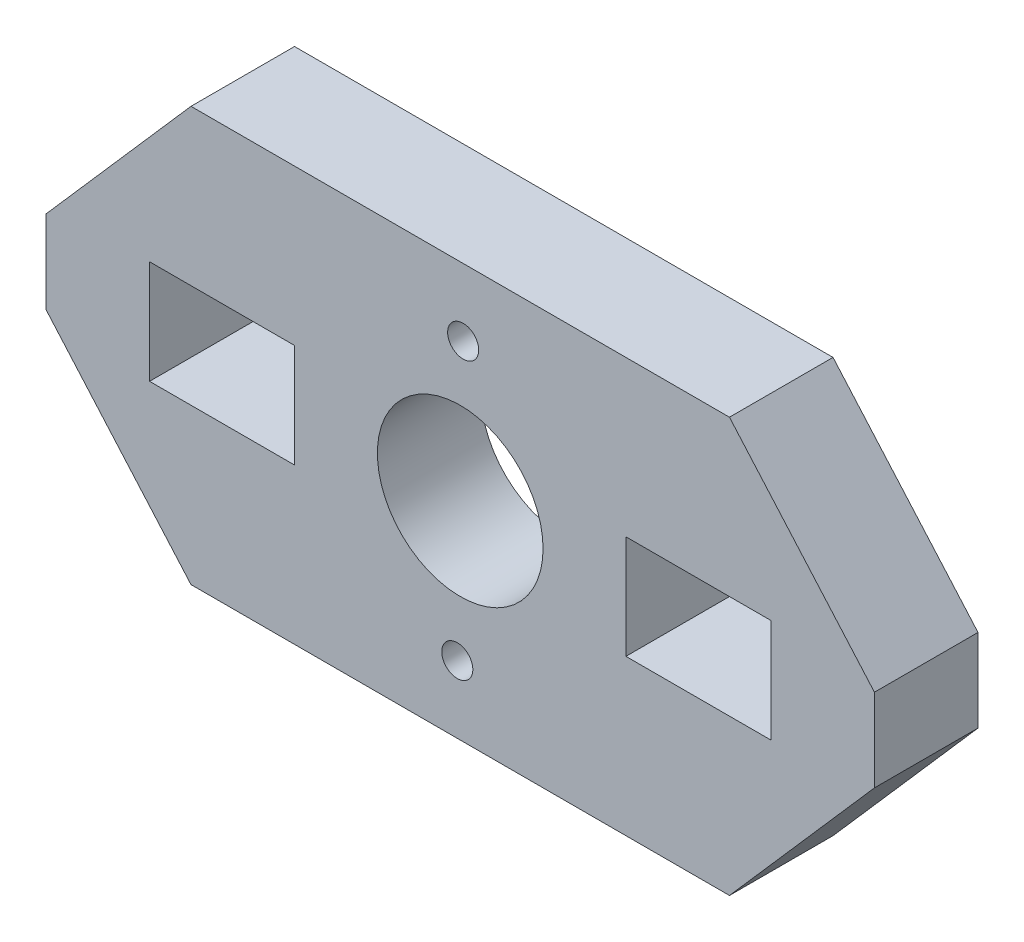
ISO-10303-21;
HEADER;
FILE_DESCRIPTION(('STEP AP214'),'2;1');
FILE_NAME('part.step','',(''),(''),'','','');
FILE_SCHEMA(('AUTOMOTIVE_DESIGN { 1 0 10303 214 1 1 1 1 }'));
ENDSEC;
DATA;
#1=APPLICATION_CONTEXT('core data for automotive mechanical design processes');
#2=APPLICATION_PROTOCOL_DEFINITION('international standard','automotive_design',2000,#1);
#3=PRODUCT_CONTEXT('',#1,'mechanical');
#4=PRODUCT('Part','Part','',(#3));
#5=PRODUCT_RELATED_PRODUCT_CATEGORY('part','',(#4));
#6=PRODUCT_DEFINITION_FORMATION('','',#4);
#7=PRODUCT_DEFINITION_CONTEXT('part definition',#1,'design');
#8=PRODUCT_DEFINITION('design','',#6,#7);
#9=PRODUCT_DEFINITION_SHAPE('','',#8);
#10=(LENGTH_UNIT() NAMED_UNIT(*) SI_UNIT(.MILLI.,.METRE.));
#11=(NAMED_UNIT(*) PLANE_ANGLE_UNIT() SI_UNIT($,.RADIAN.));
#12=(NAMED_UNIT(*) SI_UNIT($,.STERADIAN.) SOLID_ANGLE_UNIT());
#13=UNCERTAINTY_MEASURE_WITH_UNIT(LENGTH_MEASURE(1.E-05),#10,'distance_accuracy_value','');
#14=(GEOMETRIC_REPRESENTATION_CONTEXT(3) GLOBAL_UNCERTAINTY_ASSIGNED_CONTEXT((#13)) GLOBAL_UNIT_ASSIGNED_CONTEXT((#10,
#11,#12)) REPRESENTATION_CONTEXT('',''));
#15=CARTESIAN_POINT('',(0.,0.,0.));
#16=DIRECTION('',(0.,0.,1.));
#17=DIRECTION('',(1.,0.,0.));
#18=AXIS2_PLACEMENT_3D('',#15,#16,#17);
#19=CARTESIAN_POINT('',(0.,0.,5.));
#20=DIRECTION('',(0.,0.,-1.));
#21=DIRECTION('',(-1.,0.,0.));
#22=AXIS2_PLACEMENT_3D('',#19,#20,#21);
#23=PLANE('',#22);
#24=DIRECTION('',(1.,0.,0.));
#25=VECTOR('',#24,1.);
#26=CARTESIAN_POINT('',(0.,-6.30714285714286,5.));
#27=LINE('',#26,#25);
#28=CARTESIAN_POINT('',(-32.7714285714286,-6.30714285714286,5.));
#29=VERTEX_POINT('',#28);
#30=CARTESIAN_POINT('',(-25.7714285714286,-6.30714285714286,5.));
#31=VERTEX_POINT('',#30);
#32=EDGE_CURVE('E210',#29,#31,#27,.T.);
#33=ORIENTED_EDGE('',*,*,#32,.T.);
#34=DIRECTION('',(0.,-1.,0.));
#35=VECTOR('',#34,1.);
#36=CARTESIAN_POINT('',(-25.7714285714286,0.,5.));
#37=LINE('',#36,#35);
#38=CARTESIAN_POINT('',(-25.7714285714286,-11.3071428571429,5.));
#39=VERTEX_POINT('',#38);
#40=EDGE_CURVE('E152',#31,#39,#37,.T.);
#41=ORIENTED_EDGE('',*,*,#40,.T.);
#42=DIRECTION('',(1.,0.,0.));
#43=VECTOR('',#42,1.);
#44=CARTESIAN_POINT('',(0.,-11.3071428571429,5.));
#45=LINE('',#44,#43);
#46=CARTESIAN_POINT('',(-32.7714285714286,-11.3071428571429,5.));
#47=VERTEX_POINT('',#46);
#48=EDGE_CURVE('E206',#47,#39,#45,.T.);
#49=ORIENTED_EDGE('',*,*,#48,.F.);
#50=DIRECTION('',(0.,-1.,0.));
#51=VECTOR('',#50,1.);
#52=CARTESIAN_POINT('',(-32.7714285714286,0.,5.));
#53=LINE('',#52,#51);
#54=EDGE_CURVE('E208',#29,#47,#53,.T.);
#55=ORIENTED_EDGE('',*,*,#54,.F.);
#56=EDGE_LOOP('',(#33,#41,#49,#55));
#57=FACE_BOUND('',#56,.T.);
#58=DIRECTION('',(-1.,0.,0.));
#59=VECTOR('',#58,1.);
#60=CARTESIAN_POINT('',(0.,-6.30714285714286,5.));
#61=LINE('',#60,#59);
#62=CARTESIAN_POINT('',(-2.77142857142857,-6.30714285714286,5.));
#63=VERTEX_POINT('',#62);
#64=CARTESIAN_POINT('',(-9.77142857142857,-6.30714285714286,5.));
#65=VERTEX_POINT('',#64);
#66=EDGE_CURVE('E201',#63,#65,#61,.T.);
#67=ORIENTED_EDGE('',*,*,#66,.F.);
#68=DIRECTION('',(0.,-1.,0.));
#69=VECTOR('',#68,1.);
#70=CARTESIAN_POINT('',(-2.77142857142857,0.,5.));
#71=LINE('',#70,#69);
#72=CARTESIAN_POINT('',(-2.77142857142857,-11.3071428571429,5.));
#73=VERTEX_POINT('',#72);
#74=EDGE_CURVE('E203',#63,#73,#71,.T.);
#75=ORIENTED_EDGE('',*,*,#74,.T.);
#76=DIRECTION('',(-1.,0.,0.));
#77=VECTOR('',#76,1.);
#78=CARTESIAN_POINT('',(0.,-11.3071428571429,5.));
#79=LINE('',#78,#77);
#80=CARTESIAN_POINT('',(-9.77142857142857,-11.3071428571429,5.));
#81=VERTEX_POINT('',#80);
#82=EDGE_CURVE('E155',#73,#81,#79,.T.);
#83=ORIENTED_EDGE('',*,*,#82,.T.);
#84=DIRECTION('',(0.,-1.,0.));
#85=VECTOR('',#84,1.);
#86=CARTESIAN_POINT('',(-9.77142857142858,0.,5.));
#87=LINE('',#86,#85);
#88=EDGE_CURVE('E199',#65,#81,#87,.T.);
#89=ORIENTED_EDGE('',*,*,#88,.F.);
#90=EDGE_LOOP('',(#67,#75,#83,#89));
#91=FACE_BOUND('',#90,.T.);
#92=DIRECTION('',(0.658504607868518,-0.752576694706878,0.));
#93=VECTOR('',#92,1.);
#94=CARTESIAN_POINT('',(-37.7714285714286,-10.8071428571429,5.));
#95=LINE('',#94,#93);
#96=CARTESIAN_POINT('',(-37.7714285714286,-10.8071428571429,5.));
#97=VERTEX_POINT('',#96);
#98=CARTESIAN_POINT('',(-30.7714285714286,-18.8071428571429,5.));
#99=VERTEX_POINT('',#98);
#100=EDGE_CURVE('E232',#97,#99,#95,.T.);
#101=ORIENTED_EDGE('',*,*,#100,.T.);
#102=DIRECTION('',(1.,0.,0.));
#103=VECTOR('',#102,1.);
#104=CARTESIAN_POINT('',(-30.7714285714286,-18.8071428571429,5.));
#105=LINE('',#104,#103);
#106=CARTESIAN_POINT('',(-4.77142857142857,-18.8071428571429,5.));
#107=VERTEX_POINT('',#106);
#108=EDGE_CURVE('E235',#99,#107,#105,.T.);
#109=ORIENTED_EDGE('',*,*,#108,.T.);
#110=DIRECTION('',(0.658504607868518,0.752576694706878,0.));
#111=VECTOR('',#110,1.);
#112=CARTESIAN_POINT('',(2.22857142857143,-10.8071428571429,5.));
#113=LINE('',#112,#111);
#114=CARTESIAN_POINT('',(2.22857142857143,-10.8071428571429,5.));
#115=VERTEX_POINT('',#114);
#116=EDGE_CURVE('E238',#107,#115,#113,.T.);
#117=ORIENTED_EDGE('',*,*,#116,.T.);
#118=DIRECTION('',(0.,1.,0.));
#119=VECTOR('',#118,1.);
#120=CARTESIAN_POINT('',(2.22857142857143,-6.80714285714286,5.));
#121=LINE('',#120,#119);
#122=CARTESIAN_POINT('',(2.22857142857143,-6.80714285714286,5.));
#123=VERTEX_POINT('',#122);
#124=EDGE_CURVE('E240',#115,#123,#121,.T.);
#125=ORIENTED_EDGE('',*,*,#124,.T.);
#126=DIRECTION('',(-0.658504607868518,0.752576694706878,0.));
#127=VECTOR('',#126,1.);
#128=CARTESIAN_POINT('',(-4.77142857142858,1.19285714285715,5.));
#129=LINE('',#128,#127);
#130=CARTESIAN_POINT('',(-4.77142857142858,1.19285714285715,5.));
#131=VERTEX_POINT('',#130);
#132=EDGE_CURVE('E242',#123,#131,#129,.T.);
#133=ORIENTED_EDGE('',*,*,#132,.T.);
#134=DIRECTION('',(-1.,0.,0.));
#135=VECTOR('',#134,1.);
#136=CARTESIAN_POINT('',(-30.7714285714286,1.19285714285714,5.));
#137=LINE('',#136,#135);
#138=CARTESIAN_POINT('',(-30.7714285714286,1.19285714285714,5.));
#139=VERTEX_POINT('',#138);
#140=EDGE_CURVE('E244',#131,#139,#137,.T.);
#141=ORIENTED_EDGE('',*,*,#140,.T.);
#142=DIRECTION('',(-0.658504607868518,-0.752576694706878,0.));
#143=VECTOR('',#142,1.);
#144=CARTESIAN_POINT('',(-30.7714285714286,1.19285714285714,5.));
#145=LINE('',#144,#143);
#146=CARTESIAN_POINT('',(-37.7714285714286,-6.80714285714286,5.));
#147=VERTEX_POINT('',#146);
#148=EDGE_CURVE('E246',#139,#147,#145,.T.);
#149=ORIENTED_EDGE('',*,*,#148,.T.);
#150=DIRECTION('',(0.,-1.,0.));
#151=VECTOR('',#150,1.);
#152=CARTESIAN_POINT('',(-37.7714285714286,-6.80714285714286,5.));
#153=LINE('',#152,#151);
#154=EDGE_CURVE('E248',#147,#97,#153,.T.);
#155=ORIENTED_EDGE('',*,*,#154,.T.);
#156=EDGE_LOOP('',(#101,#109,#117,#125,#133,#141,#149,#155));
#157=FACE_BOUND('',#156,.T.);
#158=CARTESIAN_POINT('',(-17.7714285714286,-8.80714285714286,5.));
#159=DIRECTION('',(0.,0.,1.));
#160=DIRECTION('',(1.,0.,0.));
#161=AXIS2_PLACEMENT_3D('',#158,#159,#160);
#162=CIRCLE('',#161,4.);
#163=CARTESIAN_POINT('',(-13.7714285714286,-8.80714285714286,5.));
#164=VERTEX_POINT('',#163);
#165=EDGE_CURVE('E226',#164,#164,#162,.T.);
#166=ORIENTED_EDGE('',*,*,#165,.F.);
#167=EDGE_LOOP('',(#166));
#168=FACE_BOUND('',#167,.T.);
#169=CARTESIAN_POINT('',(-17.6297454846945,-2.05863013549594,5.));
#170=DIRECTION('',(0.,0.,1.));
#171=DIRECTION('',(1.,0.,0.));
#172=AXIS2_PLACEMENT_3D('',#169,#170,#171);
#173=CIRCLE('',#172,0.749999999999998);
#174=CARTESIAN_POINT('',(-16.8797454846945,-2.05863013549594,5.));
#175=VERTEX_POINT('',#174);
#176=EDGE_CURVE('E220',#175,#175,#173,.T.);
#177=ORIENTED_EDGE('',*,*,#176,.F.);
#178=EDGE_LOOP('',(#177));
#179=FACE_BOUND('',#178,.T.);
#180=CARTESIAN_POINT('',(-17.9131116635467,-15.5556558674371,5.));
#181=DIRECTION('',(0.,0.,1.));
#182=DIRECTION('',(1.,0.,0.));
#183=AXIS2_PLACEMENT_3D('',#180,#181,#182);
#184=CIRCLE('',#183,0.749999999999999);
#185=CARTESIAN_POINT('',(-17.1631116635467,-15.5556558674371,5.));
#186=VERTEX_POINT('',#185);
#187=EDGE_CURVE('E214',#186,#186,#184,.T.);
#188=ORIENTED_EDGE('',*,*,#187,.F.);
#189=EDGE_LOOP('',(#188));
#190=FACE_BOUND('',#189,.T.);
#191=ADVANCED_FACE('F32',(#57,#91,#157,#168,#179,#190),#23,.F.);
#192=CARTESIAN_POINT('',(0.,0.,0.));
#193=DIRECTION('',(0.,0.,-1.));
#194=DIRECTION('',(-1.,0.,0.));
#195=AXIS2_PLACEMENT_3D('',#192,#193,#194);
#196=PLANE('',#195);
#197=DIRECTION('',(0.,-1.,0.));
#198=VECTOR('',#197,1.);
#199=CARTESIAN_POINT('',(-25.7714285714286,0.,0.));
#200=LINE('',#199,#198);
#201=CARTESIAN_POINT('',(-25.7714285714286,-6.30714285714286,0.));
#202=VERTEX_POINT('',#201);
#203=CARTESIAN_POINT('',(-25.7714285714286,-11.3071428571429,0.));
#204=VERTEX_POINT('',#203);
#205=EDGE_CURVE('E149',#202,#204,#200,.T.);
#206=ORIENTED_EDGE('',*,*,#205,.F.);
#207=DIRECTION('',(1.,0.,0.));
#208=VECTOR('',#207,1.);
#209=CARTESIAN_POINT('',(0.,-6.30714285714286,0.));
#210=LINE('',#209,#208);
#211=CARTESIAN_POINT('',(-32.7714285714286,-6.30714285714286,0.));
#212=VERTEX_POINT('',#211);
#213=EDGE_CURVE('E159',#212,#202,#210,.T.);
#214=ORIENTED_EDGE('',*,*,#213,.F.);
#215=DIRECTION('',(0.,-1.,0.));
#216=VECTOR('',#215,1.);
#217=CARTESIAN_POINT('',(-32.7714285714286,0.,0.));
#218=LINE('',#217,#216);
#219=CARTESIAN_POINT('',(-32.7714285714286,-11.3071428571429,0.));
#220=VERTEX_POINT('',#219);
#221=EDGE_CURVE('E165',#212,#220,#218,.T.);
#222=ORIENTED_EDGE('',*,*,#221,.T.);
#223=DIRECTION('',(1.,0.,0.));
#224=VECTOR('',#223,1.);
#225=CARTESIAN_POINT('',(0.,-11.3071428571429,0.));
#226=LINE('',#225,#224);
#227=EDGE_CURVE('E170',#220,#204,#226,.T.);
#228=ORIENTED_EDGE('',*,*,#227,.T.);
#229=EDGE_LOOP('',(#206,#214,#222,#228));
#230=FACE_BOUND('',#229,.T.);
#231=DIRECTION('',(0.,-1.,0.));
#232=VECTOR('',#231,1.);
#233=CARTESIAN_POINT('',(-2.77142857142857,0.,0.));
#234=LINE('',#233,#232);
#235=CARTESIAN_POINT('',(-2.77142857142857,-6.30714285714286,0.));
#236=VERTEX_POINT('',#235);
#237=CARTESIAN_POINT('',(-2.77142857142857,-11.3071428571429,0.));
#238=VERTEX_POINT('',#237);
#239=EDGE_CURVE('E182',#236,#238,#234,.T.);
#240=ORIENTED_EDGE('',*,*,#239,.F.);
#241=DIRECTION('',(-1.,0.,0.));
#242=VECTOR('',#241,1.);
#243=CARTESIAN_POINT('',(0.,-6.30714285714286,0.));
#244=LINE('',#243,#242);
#245=CARTESIAN_POINT('',(-9.77142857142857,-6.30714285714286,0.));
#246=VERTEX_POINT('',#245);
#247=EDGE_CURVE('E184',#236,#246,#244,.T.);
#248=ORIENTED_EDGE('',*,*,#247,.T.);
#249=DIRECTION('',(0.,-1.,0.));
#250=VECTOR('',#249,1.);
#251=CARTESIAN_POINT('',(-9.77142857142858,0.,0.));
#252=LINE('',#251,#250);
#253=CARTESIAN_POINT('',(-9.77142857142857,-11.3071428571429,0.));
#254=VERTEX_POINT('',#253);
#255=EDGE_CURVE('E187',#246,#254,#252,.T.);
#256=ORIENTED_EDGE('',*,*,#255,.T.);
#257=DIRECTION('',(-1.,0.,0.));
#258=VECTOR('',#257,1.);
#259=CARTESIAN_POINT('',(0.,-11.3071428571429,0.));
#260=LINE('',#259,#258);
#261=EDGE_CURVE('E190',#238,#254,#260,.T.);
#262=ORIENTED_EDGE('',*,*,#261,.F.);
#263=EDGE_LOOP('',(#240,#248,#256,#262));
#264=FACE_BOUND('',#263,.T.);
#265=CARTESIAN_POINT('',(-17.6297454846945,-2.05863013549594,0.));
#266=DIRECTION('',(0.,0.,1.));
#267=DIRECTION('',(1.,0.,0.));
#268=AXIS2_PLACEMENT_3D('',#265,#266,#267);
#269=CIRCLE('',#268,0.749999999999998);
#270=CARTESIAN_POINT('',(-16.8797454846945,-2.05863013549594,0.));
#271=VERTEX_POINT('',#270);
#272=EDGE_CURVE('E217',#271,#271,#269,.T.);
#273=ORIENTED_EDGE('',*,*,#272,.T.);
#274=EDGE_LOOP('',(#273));
#275=FACE_BOUND('',#274,.T.);
#276=DIRECTION('',(0.658504607868518,-0.752576694706878,0.));
#277=VECTOR('',#276,1.);
#278=CARTESIAN_POINT('',(-37.7714285714286,-10.8071428571429,0.));
#279=LINE('',#278,#277);
#280=CARTESIAN_POINT('',(-37.7714285714286,-10.8071428571429,0.));
#281=VERTEX_POINT('',#280);
#282=CARTESIAN_POINT('',(-30.7714285714286,-18.8071428571429,0.));
#283=VERTEX_POINT('',#282);
#284=EDGE_CURVE('E229',#281,#283,#279,.T.);
#285=ORIENTED_EDGE('',*,*,#284,.F.);
#286=DIRECTION('',(0.,-1.,0.));
#287=VECTOR('',#286,1.);
#288=CARTESIAN_POINT('',(-37.7714285714286,-6.80714285714286,0.));
#289=LINE('',#288,#287);
#290=CARTESIAN_POINT('',(-37.7714285714286,-6.80714285714286,0.));
#291=VERTEX_POINT('',#290);
#292=EDGE_CURVE('E236',#291,#281,#289,.T.);
#293=ORIENTED_EDGE('',*,*,#292,.F.);
#294=DIRECTION('',(-0.658504607868518,-0.752576694706878,0.));
#295=VECTOR('',#294,1.);
#296=CARTESIAN_POINT('',(-30.7714285714286,1.19285714285714,0.));
#297=LINE('',#296,#295);
#298=CARTESIAN_POINT('',(-30.7714285714286,1.19285714285714,0.));
#299=VERTEX_POINT('',#298);
#300=EDGE_CURVE('E263',#299,#291,#297,.T.);
#301=ORIENTED_EDGE('',*,*,#300,.F.);
#302=DIRECTION('',(-1.,0.,0.));
#303=VECTOR('',#302,1.);
#304=CARTESIAN_POINT('',(-30.7714285714286,1.19285714285714,0.));
#305=LINE('',#304,#303);
#306=CARTESIAN_POINT('',(-4.77142857142858,1.19285714285715,0.));
#307=VERTEX_POINT('',#306);
#308=EDGE_CURVE('E261',#307,#299,#305,.T.);
#309=ORIENTED_EDGE('',*,*,#308,.F.);
#310=DIRECTION('',(-0.658504607868518,0.752576694706878,0.));
#311=VECTOR('',#310,1.);
#312=CARTESIAN_POINT('',(-4.77142857142858,1.19285714285715,0.));
#313=LINE('',#312,#311);
#314=CARTESIAN_POINT('',(2.22857142857143,-6.80714285714286,0.));
#315=VERTEX_POINT('',#314);
#316=EDGE_CURVE('E259',#315,#307,#313,.T.);
#317=ORIENTED_EDGE('',*,*,#316,.F.);
#318=DIRECTION('',(0.,1.,0.));
#319=VECTOR('',#318,1.);
#320=CARTESIAN_POINT('',(2.22857142857143,-6.80714285714286,0.));
#321=LINE('',#320,#319);
#322=CARTESIAN_POINT('',(2.22857142857143,-10.8071428571429,0.));
#323=VERTEX_POINT('',#322);
#324=EDGE_CURVE('E257',#323,#315,#321,.T.);
#325=ORIENTED_EDGE('',*,*,#324,.F.);
#326=DIRECTION('',(0.658504607868518,0.752576694706878,0.));
#327=VECTOR('',#326,1.);
#328=CARTESIAN_POINT('',(2.22857142857143,-10.8071428571429,0.));
#329=LINE('',#328,#327);
#330=CARTESIAN_POINT('',(-4.77142857142857,-18.8071428571429,0.));
#331=VERTEX_POINT('',#330);
#332=EDGE_CURVE('E255',#331,#323,#329,.T.);
#333=ORIENTED_EDGE('',*,*,#332,.F.);
#334=DIRECTION('',(1.,0.,0.));
#335=VECTOR('',#334,1.);
#336=CARTESIAN_POINT('',(-30.7714285714286,-18.8071428571429,0.));
#337=LINE('',#336,#335);
#338=EDGE_CURVE('E253',#283,#331,#337,.T.);
#339=ORIENTED_EDGE('',*,*,#338,.F.);
#340=EDGE_LOOP('',(#285,#293,#301,#309,#317,#325,#333,#339));
#341=FACE_BOUND('',#340,.T.);
#342=CARTESIAN_POINT('',(-17.7714285714286,-8.80714285714286,0.));
#343=DIRECTION('',(0.,0.,1.));
#344=DIRECTION('',(1.,0.,0.));
#345=AXIS2_PLACEMENT_3D('',#342,#343,#344);
#346=CIRCLE('',#345,4.);
#347=CARTESIAN_POINT('',(-13.7714285714286,-8.80714285714286,0.));
#348=VERTEX_POINT('',#347);
#349=EDGE_CURVE('E223',#348,#348,#346,.T.);
#350=ORIENTED_EDGE('',*,*,#349,.T.);
#351=EDGE_LOOP('',(#350));
#352=FACE_BOUND('',#351,.T.);
#353=CARTESIAN_POINT('',(-17.9131116635467,-15.5556558674371,0.));
#354=DIRECTION('',(0.,0.,1.));
#355=DIRECTION('',(1.,0.,0.));
#356=AXIS2_PLACEMENT_3D('',#353,#354,#355);
#357=CIRCLE('',#356,0.749999999999999);
#358=CARTESIAN_POINT('',(-17.1631116635467,-15.5556558674371,0.));
#359=VERTEX_POINT('',#358);
#360=EDGE_CURVE('E213',#359,#359,#357,.T.);
#361=ORIENTED_EDGE('',*,*,#360,.T.);
#362=EDGE_LOOP('',(#361));
#363=FACE_BOUND('',#362,.T.);
#364=ADVANCED_FACE('F168',(#230,#264,#275,#341,#352,#363),#196,.T.);
#365=CARTESIAN_POINT('',(-37.7714285714286,-10.8071428571429,5.));
#366=DIRECTION('',(0.752576694706878,0.658504607868518,0.));
#367=DIRECTION('',(-0.658504607868518,0.752576694706878,0.));
#368=AXIS2_PLACEMENT_3D('',#365,#366,#367);
#369=PLANE('',#368);
#370=ORIENTED_EDGE('',*,*,#284,.T.);
#371=DIRECTION('',(0.,0.,-1.));
#372=VECTOR('',#371,1.);
#373=CARTESIAN_POINT('',(-30.7714285714286,-18.8071428571429,5.));
#374=LINE('',#373,#372);
#375=EDGE_CURVE('E11',#99,#283,#374,.T.);
#376=ORIENTED_EDGE('',*,*,#375,.F.);
#377=ORIENTED_EDGE('',*,*,#100,.F.);
#378=DIRECTION('',(0.,0.,-1.));
#379=VECTOR('',#378,1.);
#380=CARTESIAN_POINT('',(-37.7714285714286,-10.8071428571429,5.));
#381=LINE('',#380,#379);
#382=EDGE_CURVE('E250',#97,#281,#381,.T.);
#383=ORIENTED_EDGE('',*,*,#382,.T.);
#384=EDGE_LOOP('',(#370,#376,#377,#383));
#385=FACE_BOUND('',#384,.T.);
#386=ADVANCED_FACE('F34',(#385),#369,.F.);
#387=CARTESIAN_POINT('',(-30.7714285714286,-18.8071428571429,5.));
#388=DIRECTION('',(0.,1.,0.));
#389=DIRECTION('',(0.,0.,1.));
#390=AXIS2_PLACEMENT_3D('',#387,#388,#389);
#391=PLANE('',#390);
#392=ORIENTED_EDGE('',*,*,#338,.T.);
#393=DIRECTION('',(0.,0.,-1.));
#394=VECTOR('',#393,1.);
#395=CARTESIAN_POINT('',(-4.77142857142857,-18.8071428571429,5.));
#396=LINE('',#395,#394);
#397=EDGE_CURVE('E40',#107,#331,#396,.T.);
#398=ORIENTED_EDGE('',*,*,#397,.F.);
#399=ORIENTED_EDGE('',*,*,#108,.F.);
#400=ORIENTED_EDGE('',*,*,#375,.T.);
#401=EDGE_LOOP('',(#392,#398,#399,#400));
#402=FACE_BOUND('',#401,.T.);
#403=ADVANCED_FACE('F310',(#402),#391,.F.);
#404=CARTESIAN_POINT('',(2.22857142857143,-10.8071428571429,5.));
#405=DIRECTION('',(-0.752576694706878,0.658504607868518,0.));
#406=DIRECTION('',(-0.658504607868518,-0.752576694706878,0.));
#407=AXIS2_PLACEMENT_3D('',#404,#405,#406);
#408=PLANE('',#407);
#409=ORIENTED_EDGE('',*,*,#332,.T.);
#410=DIRECTION('',(0.,0.,-1.));
#411=VECTOR('',#410,1.);
#412=CARTESIAN_POINT('',(2.22857142857143,-10.8071428571429,5.));
#413=LINE('',#412,#411);
#414=EDGE_CURVE('E280',#115,#323,#413,.T.);
#415=ORIENTED_EDGE('',*,*,#414,.F.);
#416=ORIENTED_EDGE('',*,*,#116,.F.);
#417=ORIENTED_EDGE('',*,*,#397,.T.);
#418=EDGE_LOOP('',(#409,#415,#416,#417));
#419=FACE_BOUND('',#418,.T.);
#420=ADVANCED_FACE('F287',(#419),#408,.F.);
#421=CARTESIAN_POINT('',(2.22857142857143,-6.80714285714286,5.));
#422=DIRECTION('',(-1.,0.,0.));
#423=DIRECTION('',(0.,0.,1.));
#424=AXIS2_PLACEMENT_3D('',#421,#422,#423);
#425=PLANE('',#424);
#426=ORIENTED_EDGE('',*,*,#324,.T.);
#427=DIRECTION('',(0.,0.,-1.));
#428=VECTOR('',#427,1.);
#429=CARTESIAN_POINT('',(2.22857142857143,-6.80714285714286,5.));
#430=LINE('',#429,#428);
#431=EDGE_CURVE('E277',#123,#315,#430,.T.);
#432=ORIENTED_EDGE('',*,*,#431,.F.);
#433=ORIENTED_EDGE('',*,*,#124,.F.);
#434=ORIENTED_EDGE('',*,*,#414,.T.);
#435=EDGE_LOOP('',(#426,#432,#433,#434));
#436=FACE_BOUND('',#435,.T.);
#437=ADVANCED_FACE('F298',(#436),#425,.F.);
#438=CARTESIAN_POINT('',(-4.77142857142858,1.19285714285715,5.));
#439=DIRECTION('',(-0.752576694706878,-0.658504607868518,0.));
#440=DIRECTION('',(0.658504607868518,-0.752576694706878,0.));
#441=AXIS2_PLACEMENT_3D('',#438,#439,#440);
#442=PLANE('',#441);
#443=ORIENTED_EDGE('',*,*,#316,.T.);
#444=DIRECTION('',(0.,0.,-1.));
#445=VECTOR('',#444,1.);
#446=CARTESIAN_POINT('',(-4.77142857142858,1.19285714285715,5.));
#447=LINE('',#446,#445);
#448=EDGE_CURVE('E274',#131,#307,#447,.T.);
#449=ORIENTED_EDGE('',*,*,#448,.F.);
#450=ORIENTED_EDGE('',*,*,#132,.F.);
#451=ORIENTED_EDGE('',*,*,#431,.T.);
#452=EDGE_LOOP('',(#443,#449,#450,#451));
#453=FACE_BOUND('',#452,.T.);
#454=ADVANCED_FACE('F302',(#453),#442,.F.);
#455=CARTESIAN_POINT('',(-30.7714285714286,1.19285714285714,5.));
#456=DIRECTION('',(0.,-1.,0.));
#457=DIRECTION('',(1.,0.,0.));
#458=AXIS2_PLACEMENT_3D('',#455,#456,#457);
#459=PLANE('',#458);
#460=ORIENTED_EDGE('',*,*,#308,.T.);
#461=DIRECTION('',(0.,0.,-1.));
#462=VECTOR('',#461,1.);
#463=CARTESIAN_POINT('',(-30.7714285714286,1.19285714285714,5.));
#464=LINE('',#463,#462);
#465=EDGE_CURVE('E271',#139,#299,#464,.T.);
#466=ORIENTED_EDGE('',*,*,#465,.F.);
#467=ORIENTED_EDGE('',*,*,#140,.F.);
#468=ORIENTED_EDGE('',*,*,#448,.T.);
#469=EDGE_LOOP('',(#460,#466,#467,#468));
#470=FACE_BOUND('',#469,.T.);
#471=ADVANCED_FACE('F323',(#470),#459,.F.);
#472=CARTESIAN_POINT('',(-30.7714285714286,1.19285714285714,5.));
#473=DIRECTION('',(0.752576694706878,-0.658504607868518,0.));
#474=DIRECTION('',(0.658504607868518,0.752576694706878,0.));
#475=AXIS2_PLACEMENT_3D('',#472,#473,#474);
#476=PLANE('',#475);
#477=ORIENTED_EDGE('',*,*,#300,.T.);
#478=DIRECTION('',(0.,0.,-1.));
#479=VECTOR('',#478,1.);
#480=CARTESIAN_POINT('',(-37.7714285714286,-6.80714285714286,5.));
#481=LINE('',#480,#479);
#482=EDGE_CURVE('E268',#147,#291,#481,.T.);
#483=ORIENTED_EDGE('',*,*,#482,.F.);
#484=ORIENTED_EDGE('',*,*,#148,.F.);
#485=ORIENTED_EDGE('',*,*,#465,.T.);
#486=EDGE_LOOP('',(#477,#483,#484,#485));
#487=FACE_BOUND('',#486,.T.);
#488=ADVANCED_FACE('F321',(#487),#476,.F.);
#489=CARTESIAN_POINT('',(-37.7714285714286,-6.80714285714286,5.));
#490=DIRECTION('',(1.,0.,0.));
#491=DIRECTION('',(0.,0.,-1.));
#492=AXIS2_PLACEMENT_3D('',#489,#490,#491);
#493=PLANE('',#492);
#494=ORIENTED_EDGE('',*,*,#292,.T.);
#495=ORIENTED_EDGE('',*,*,#382,.F.);
#496=ORIENTED_EDGE('',*,*,#154,.F.);
#497=ORIENTED_EDGE('',*,*,#482,.T.);
#498=EDGE_LOOP('',(#494,#495,#496,#497));
#499=FACE_BOUND('',#498,.T.);
#500=ADVANCED_FACE('F316',(#499),#493,.F.);
#501=CARTESIAN_POINT('',(-17.7714285714286,-8.80714285714286,5.));
#502=DIRECTION('',(0.,0.,-1.));
#503=DIRECTION('',(-1.,0.,0.));
#504=AXIS2_PLACEMENT_3D('',#501,#502,#503);
#505=CYLINDRICAL_SURFACE('',#504,4.);
#506=ORIENTED_EDGE('',*,*,#165,.T.);
#507=EDGE_LOOP('',(#506));
#508=FACE_BOUND('',#507,.T.);
#509=ORIENTED_EDGE('',*,*,#349,.F.);
#510=EDGE_LOOP('',(#509));
#511=FACE_BOUND('',#510,.T.);
#512=ADVANCED_FACE('F341',(#508,#511),#505,.F.);
#513=CARTESIAN_POINT('',(-17.6297454846945,-2.05863013549594,5.));
#514=DIRECTION('',(0.,0.,-1.));
#515=DIRECTION('',(-1.,0.,0.));
#516=AXIS2_PLACEMENT_3D('',#513,#514,#515);
#517=CYLINDRICAL_SURFACE('',#516,0.749999999999998);
#518=ORIENTED_EDGE('',*,*,#176,.T.);
#519=EDGE_LOOP('',(#518));
#520=FACE_BOUND('',#519,.T.);
#521=ORIENTED_EDGE('',*,*,#272,.F.);
#522=EDGE_LOOP('',(#521));
#523=FACE_BOUND('',#522,.T.);
#524=ADVANCED_FACE('F348',(#520,#523),#517,.F.);
#525=CARTESIAN_POINT('',(-17.9131116635467,-15.5556558674371,5.));
#526=DIRECTION('',(0.,0.,-1.));
#527=DIRECTION('',(-1.,0.,0.));
#528=AXIS2_PLACEMENT_3D('',#525,#526,#527);
#529=CYLINDRICAL_SURFACE('',#528,0.749999999999999);
#530=ORIENTED_EDGE('',*,*,#187,.T.);
#531=EDGE_LOOP('',(#530));
#532=FACE_BOUND('',#531,.T.);
#533=ORIENTED_EDGE('',*,*,#360,.F.);
#534=EDGE_LOOP('',(#533));
#535=FACE_BOUND('',#534,.T.);
#536=ADVANCED_FACE('F353',(#532,#535),#529,.F.);
#537=CARTESIAN_POINT('',(-2.77142857142857,0.,10.));
#538=DIRECTION('',(1.,0.,0.));
#539=DIRECTION('',(0.,0.,-1.));
#540=AXIS2_PLACEMENT_3D('',#537,#538,#539);
#541=PLANE('',#540);
#542=DIRECTION('',(0.,0.,-1.));
#543=VECTOR('',#542,1.);
#544=CARTESIAN_POINT('',(-2.77142857142857,-6.30714285714286,10.));
#545=LINE('',#544,#543);
#546=EDGE_CURVE('E171',#63,#236,#545,.T.);
#547=ORIENTED_EDGE('',*,*,#546,.T.);
#548=ORIENTED_EDGE('',*,*,#239,.T.);
#549=DIRECTION('',(0.,0.,-1.));
#550=VECTOR('',#549,1.);
#551=CARTESIAN_POINT('',(-2.77142857142857,-11.3071428571429,10.));
#552=LINE('',#551,#550);
#553=EDGE_CURVE('E192',#73,#238,#552,.T.);
#554=ORIENTED_EDGE('',*,*,#553,.F.);
#555=ORIENTED_EDGE('',*,*,#74,.F.);
#556=EDGE_LOOP('',(#547,#548,#554,#555));
#557=FACE_BOUND('',#556,.T.);
#558=ADVANCED_FACE('F362',(#557),#541,.F.);
#559=CARTESIAN_POINT('',(0.,-6.30714285714286,10.));
#560=DIRECTION('',(0.,-1.,0.));
#561=DIRECTION('',(1.,0.,0.));
#562=AXIS2_PLACEMENT_3D('',#559,#560,#561);
#563=PLANE('',#562);
#564=ORIENTED_EDGE('',*,*,#66,.T.);
#565=DIRECTION('',(0.,0.,-1.));
#566=VECTOR('',#565,1.);
#567=CARTESIAN_POINT('',(-9.77142857142857,-6.30714285714286,10.));
#568=LINE('',#567,#566);
#569=EDGE_CURVE('E173',#65,#246,#568,.T.);
#570=ORIENTED_EDGE('',*,*,#569,.T.);
#571=ORIENTED_EDGE('',*,*,#247,.F.);
#572=ORIENTED_EDGE('',*,*,#546,.F.);
#573=EDGE_LOOP('',(#564,#570,#571,#572));
#574=FACE_BOUND('',#573,.T.);
#575=ADVANCED_FACE('F368',(#574),#563,.T.);
#576=CARTESIAN_POINT('',(-9.77142857142858,0.,10.));
#577=DIRECTION('',(1.,0.,0.));
#578=DIRECTION('',(0.,1.,0.));
#579=AXIS2_PLACEMENT_3D('',#576,#577,#578);
#580=PLANE('',#579);
#581=ORIENTED_EDGE('',*,*,#88,.T.);
#582=DIRECTION('',(0.,0.,-1.));
#583=VECTOR('',#582,1.);
#584=CARTESIAN_POINT('',(-9.77142857142857,-11.3071428571429,10.));
#585=LINE('',#584,#583);
#586=EDGE_CURVE('E55',#81,#254,#585,.T.);
#587=ORIENTED_EDGE('',*,*,#586,.T.);
#588=ORIENTED_EDGE('',*,*,#255,.F.);
#589=ORIENTED_EDGE('',*,*,#569,.F.);
#590=EDGE_LOOP('',(#581,#587,#588,#589));
#591=FACE_BOUND('',#590,.T.);
#592=ADVANCED_FACE('F374',(#591),#580,.T.);
#593=CARTESIAN_POINT('',(0.,-11.3071428571429,10.));
#594=DIRECTION('',(0.,-1.,0.));
#595=DIRECTION('',(0.,0.,-1.));
#596=AXIS2_PLACEMENT_3D('',#593,#594,#595);
#597=PLANE('',#596);
#598=ORIENTED_EDGE('',*,*,#553,.T.);
#599=ORIENTED_EDGE('',*,*,#261,.T.);
#600=ORIENTED_EDGE('',*,*,#586,.F.);
#601=ORIENTED_EDGE('',*,*,#82,.F.);
#602=EDGE_LOOP('',(#598,#599,#600,#601));
#603=FACE_BOUND('',#602,.T.);
#604=ADVANCED_FACE('F378',(#603),#597,.F.);
#605=CARTESIAN_POINT('',(-25.7714285714286,0.,10.));
#606=DIRECTION('',(1.,0.,0.));
#607=DIRECTION('',(0.,1.,0.));
#608=AXIS2_PLACEMENT_3D('',#605,#606,#607);
#609=PLANE('',#608);
#610=DIRECTION('',(0.,0.,-1.));
#611=VECTOR('',#610,1.);
#612=CARTESIAN_POINT('',(-25.7714285714286,-6.30714285714286,10.));
#613=LINE('',#612,#611);
#614=EDGE_CURVE('E144',#31,#202,#613,.T.);
#615=ORIENTED_EDGE('',*,*,#614,.T.);
#616=ORIENTED_EDGE('',*,*,#205,.T.);
#617=DIRECTION('',(0.,0.,-1.));
#618=VECTOR('',#617,1.);
#619=CARTESIAN_POINT('',(-25.7714285714286,-11.3071428571429,10.));
#620=LINE('',#619,#618);
#621=EDGE_CURVE('E178',#39,#204,#620,.T.);
#622=ORIENTED_EDGE('',*,*,#621,.F.);
#623=ORIENTED_EDGE('',*,*,#40,.F.);
#624=EDGE_LOOP('',(#615,#616,#622,#623));
#625=FACE_BOUND('',#624,.T.);
#626=ADVANCED_FACE('F146',(#625),#609,.F.);
#627=CARTESIAN_POINT('',(0.,-6.30714285714286,10.));
#628=DIRECTION('',(0.,1.,0.));
#629=DIRECTION('',(0.,0.,1.));
#630=AXIS2_PLACEMENT_3D('',#627,#628,#629);
#631=PLANE('',#630);
#632=DIRECTION('',(0.,0.,-1.));
#633=VECTOR('',#632,1.);
#634=CARTESIAN_POINT('',(-32.7714285714286,-6.30714285714286,10.));
#635=LINE('',#634,#633);
#636=EDGE_CURVE('E156',#29,#212,#635,.T.);
#637=ORIENTED_EDGE('',*,*,#636,.T.);
#638=ORIENTED_EDGE('',*,*,#213,.T.);
#639=ORIENTED_EDGE('',*,*,#614,.F.);
#640=ORIENTED_EDGE('',*,*,#32,.F.);
#641=EDGE_LOOP('',(#637,#638,#639,#640));
#642=FACE_BOUND('',#641,.T.);
#643=ADVANCED_FACE('F160',(#642),#631,.F.);
#644=CARTESIAN_POINT('',(-32.7714285714286,0.,10.));
#645=DIRECTION('',(1.,0.,0.));
#646=DIRECTION('',(0.,0.,-1.));
#647=AXIS2_PLACEMENT_3D('',#644,#645,#646);
#648=PLANE('',#647);
#649=ORIENTED_EDGE('',*,*,#54,.T.);
#650=DIRECTION('',(0.,0.,-1.));
#651=VECTOR('',#650,1.);
#652=CARTESIAN_POINT('',(-32.7714285714286,-11.3071428571429,10.));
#653=LINE('',#652,#651);
#654=EDGE_CURVE('E47',#47,#220,#653,.T.);
#655=ORIENTED_EDGE('',*,*,#654,.T.);
#656=ORIENTED_EDGE('',*,*,#221,.F.);
#657=ORIENTED_EDGE('',*,*,#636,.F.);
#658=EDGE_LOOP('',(#649,#655,#656,#657));
#659=FACE_BOUND('',#658,.T.);
#660=ADVANCED_FACE('F386',(#659),#648,.T.);
#661=CARTESIAN_POINT('',(0.,-11.3071428571429,10.));
#662=DIRECTION('',(0.,1.,0.));
#663=DIRECTION('',(0.,0.,1.));
#664=AXIS2_PLACEMENT_3D('',#661,#662,#663);
#665=PLANE('',#664);
#666=ORIENTED_EDGE('',*,*,#48,.T.);
#667=ORIENTED_EDGE('',*,*,#621,.T.);
#668=ORIENTED_EDGE('',*,*,#227,.F.);
#669=ORIENTED_EDGE('',*,*,#654,.F.);
#670=EDGE_LOOP('',(#666,#667,#668,#669));
#671=FACE_BOUND('',#670,.T.);
#672=ADVANCED_FACE('F389',(#671),#665,.T.);
#673=CLOSED_SHELL('',(#191,#364,#386,#403,#420,#437,#454,#471,#488,#500,#512,#524,#536,#558,
#575,#592,#604,#626,#643,#660,#672));
#674=MANIFOLD_SOLID_BREP('B2',#673);
#675=ADVANCED_BREP_SHAPE_REPRESENTATION('',(#18,#674),#14);
#676=SHAPE_DEFINITION_REPRESENTATION(#9,#675);
ENDSEC;
END-ISO-10303-21;
